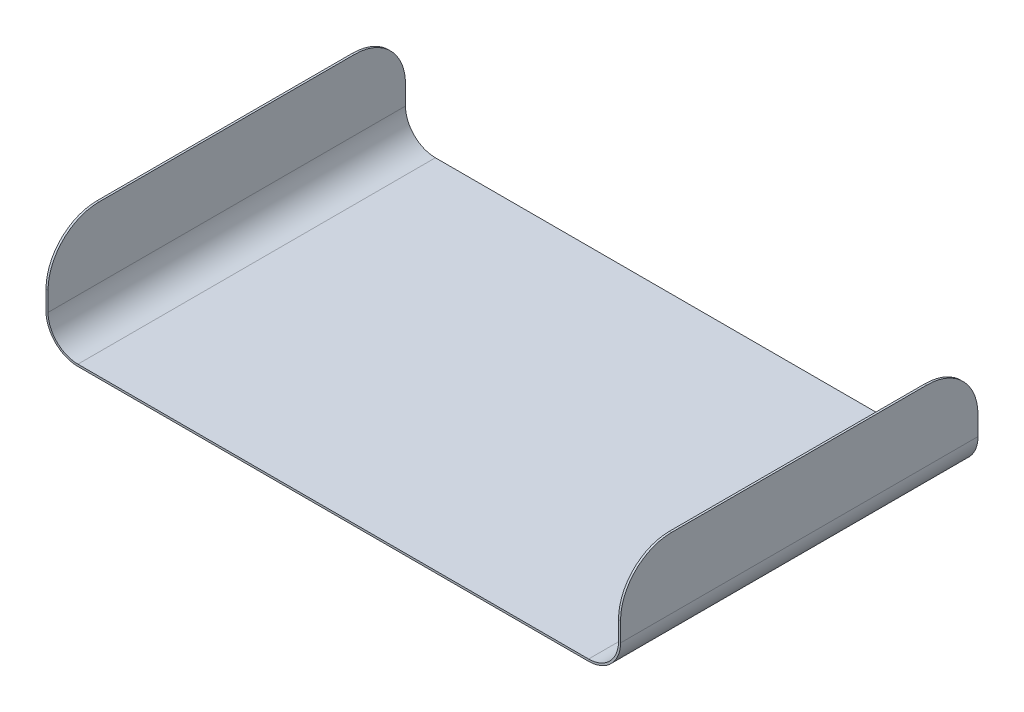
ISO-10303-21;
HEADER;
FILE_DESCRIPTION(('STEP AP214'),'2;1');
FILE_NAME('part.step','',(''),(''),'','','');
FILE_SCHEMA(('AUTOMOTIVE_DESIGN { 1 0 10303 214 1 1 1 1 }'));
ENDSEC;
DATA;
#1=APPLICATION_CONTEXT('core data for automotive mechanical design processes');
#2=APPLICATION_PROTOCOL_DEFINITION('international standard','automotive_design',2000,#1);
#3=PRODUCT_CONTEXT('',#1,'mechanical');
#4=PRODUCT('Part','Part','',(#3));
#5=PRODUCT_RELATED_PRODUCT_CATEGORY('part','',(#4));
#6=PRODUCT_DEFINITION_FORMATION('','',#4);
#7=PRODUCT_DEFINITION_CONTEXT('part definition',#1,'design');
#8=PRODUCT_DEFINITION('design','',#6,#7);
#9=PRODUCT_DEFINITION_SHAPE('','',#8);
#10=(LENGTH_UNIT() NAMED_UNIT(*) SI_UNIT(.MILLI.,.METRE.));
#11=(NAMED_UNIT(*) PLANE_ANGLE_UNIT() SI_UNIT($,.RADIAN.));
#12=(NAMED_UNIT(*) SI_UNIT($,.STERADIAN.) SOLID_ANGLE_UNIT());
#13=UNCERTAINTY_MEASURE_WITH_UNIT(LENGTH_MEASURE(1.E-05),#10,'distance_accuracy_value','');
#14=(GEOMETRIC_REPRESENTATION_CONTEXT(3) GLOBAL_UNCERTAINTY_ASSIGNED_CONTEXT((#13)) GLOBAL_UNIT_ASSIGNED_CONTEXT((#10,
#11,#12)) REPRESENTATION_CONTEXT('',''));
#15=CARTESIAN_POINT('',(0.,0.,0.));
#16=DIRECTION('',(0.,0.,1.));
#17=DIRECTION('',(1.,0.,0.));
#18=AXIS2_PLACEMENT_3D('',#15,#16,#17);
#19=CARTESIAN_POINT('',(-142.875,-168.275,88.9));
#20=DIRECTION('',(0.,-1.,0.));
#21=DIRECTION('',(0.,0.,-1.));
#22=AXIS2_PLACEMENT_3D('',#19,#20,#21);
#23=PLANE('',#22);
#24=DIRECTION('',(0.,0.,-1.));
#25=VECTOR('',#24,1.);
#26=CARTESIAN_POINT('',(-141.859,-168.275,88.9));
#27=LINE('',#26,#25);
#28=CARTESIAN_POINT('',(-141.859,-168.275,63.5));
#29=VERTEX_POINT('',#28);
#30=CARTESIAN_POINT('',(-141.859,-168.275,-63.5));
#31=VERTEX_POINT('',#30);
#32=EDGE_CURVE('E191',#29,#31,#27,.T.);
#33=ORIENTED_EDGE('',*,*,#32,.T.);
#34=DIRECTION('',(-1.,0.,0.));
#35=VECTOR('',#34,1.);
#36=CARTESIAN_POINT('',(-142.875,-168.275,-63.5));
#37=LINE('',#36,#35);
#38=CARTESIAN_POINT('',(-142.875,-168.275,-63.5));
#39=VERTEX_POINT('',#38);
#40=EDGE_CURVE('E260',#31,#39,#37,.T.);
#41=ORIENTED_EDGE('',*,*,#40,.T.);
#42=DIRECTION('',(0.,0.,-1.));
#43=VECTOR('',#42,1.);
#44=CARTESIAN_POINT('',(-142.875,-168.275,88.9));
#45=LINE('',#44,#43);
#46=CARTESIAN_POINT('',(-142.875,-168.275,63.5));
#47=VERTEX_POINT('',#46);
#48=EDGE_CURVE('E167',#47,#39,#45,.T.);
#49=ORIENTED_EDGE('',*,*,#48,.F.);
#50=DIRECTION('',(-1.,0.,0.));
#51=VECTOR('',#50,1.);
#52=CARTESIAN_POINT('',(-142.875,-168.275,63.5));
#53=LINE('',#52,#51);
#54=EDGE_CURVE('E53',#47,#29,#53,.F.);
#55=ORIENTED_EDGE('',*,*,#54,.T.);
#56=EDGE_LOOP('',(#33,#41,#49,#55));
#57=FACE_BOUND('',#56,.T.);
#58=ADVANCED_FACE('F33',(#57),#23,.F.);
#59=CARTESIAN_POINT('',(-142.875,-168.275,88.9));
#60=DIRECTION('',(1.,0.,0.));
#61=DIRECTION('',(0.,0.,-1.));
#62=AXIS2_PLACEMENT_3D('',#59,#60,#61);
#63=PLANE('',#62);
#64=ORIENTED_EDGE('',*,*,#48,.T.);
#65=CARTESIAN_POINT('',(-142.875,-193.675,-63.5));
#66=DIRECTION('',(1.,0.,0.));
#67=DIRECTION('',(0.,0.,-1.));
#68=AXIS2_PLACEMENT_3D('',#65,#66,#67);
#69=CIRCLE('',#68,25.4);
#70=CARTESIAN_POINT('',(-142.875,-193.675,-88.9));
#71=VERTEX_POINT('',#70);
#72=EDGE_CURVE('E265',#39,#71,#69,.F.);
#73=ORIENTED_EDGE('',*,*,#72,.T.);
#74=DIRECTION('',(0.,-1.,0.));
#75=VECTOR('',#74,1.);
#76=CARTESIAN_POINT('',(-142.875,-168.275,-88.9));
#77=LINE('',#76,#75);
#78=CARTESIAN_POINT('',(-142.875,-203.2,-88.9));
#79=VERTEX_POINT('',#78);
#80=EDGE_CURVE('E164',#71,#79,#77,.T.);
#81=ORIENTED_EDGE('',*,*,#80,.T.);
#82=DIRECTION('',(0.,0.,-1.));
#83=VECTOR('',#82,1.);
#84=CARTESIAN_POINT('',(-142.875,-203.2,88.9));
#85=LINE('',#84,#83);
#86=CARTESIAN_POINT('',(-142.875,-203.2,88.9));
#87=VERTEX_POINT('',#86);
#88=EDGE_CURVE('E160',#87,#79,#85,.T.);
#89=ORIENTED_EDGE('',*,*,#88,.F.);
#90=DIRECTION('',(0.,-1.,0.));
#91=VECTOR('',#90,1.);
#92=CARTESIAN_POINT('',(-142.875,-168.275,88.9));
#93=LINE('',#92,#91);
#94=CARTESIAN_POINT('',(-142.875,-193.675,88.9));
#95=VERTEX_POINT('',#94);
#96=EDGE_CURVE('E146',#95,#87,#93,.T.);
#97=ORIENTED_EDGE('',*,*,#96,.F.);
#98=CARTESIAN_POINT('',(-142.875,-193.675,63.5));
#99=DIRECTION('',(1.,0.,0.));
#100=DIRECTION('',(0.,0.,-1.));
#101=AXIS2_PLACEMENT_3D('',#98,#99,#100);
#102=CIRCLE('',#101,25.4);
#103=EDGE_CURVE('E263',#95,#47,#102,.F.);
#104=ORIENTED_EDGE('',*,*,#103,.T.);
#105=EDGE_LOOP('',(#64,#73,#81,#89,#97,#104));
#106=FACE_BOUND('',#105,.T.);
#107=ADVANCED_FACE('F162',(#106),#63,.F.);
#108=CARTESIAN_POINT('',(-127.,-203.2,88.9));
#109=DIRECTION('',(0.,0.,-1.));
#110=DIRECTION('',(-1.,0.,0.));
#111=AXIS2_PLACEMENT_3D('',#108,#109,#110);
#112=CYLINDRICAL_SURFACE('',#111,15.875);
#113=CARTESIAN_POINT('',(-127.,-203.2,-88.9));
#114=DIRECTION('',(0.,0.,1.));
#115=DIRECTION('',(-1.,0.,0.));
#116=AXIS2_PLACEMENT_3D('',#113,#114,#115);
#117=CIRCLE('',#116,15.875);
#118=CARTESIAN_POINT('',(-127.,-219.075,-88.9));
#119=VERTEX_POINT('',#118);
#120=EDGE_CURVE('E193',#79,#119,#117,.T.);
#121=ORIENTED_EDGE('',*,*,#120,.T.);
#122=DIRECTION('',(0.,0.,-1.));
#123=VECTOR('',#122,1.);
#124=CARTESIAN_POINT('',(-127.,-219.075,88.9));
#125=LINE('',#124,#123);
#126=CARTESIAN_POINT('',(-127.,-219.075,88.9));
#127=VERTEX_POINT('',#126);
#128=EDGE_CURVE('E168',#127,#119,#125,.T.);
#129=ORIENTED_EDGE('',*,*,#128,.F.);
#130=CARTESIAN_POINT('',(-127.,-203.2,88.9));
#131=DIRECTION('',(0.,0.,1.));
#132=DIRECTION('',(-1.,0.,0.));
#133=AXIS2_PLACEMENT_3D('',#130,#131,#132);
#134=CIRCLE('',#133,15.875);
#135=EDGE_CURVE('E151',#87,#127,#134,.T.);
#136=ORIENTED_EDGE('',*,*,#135,.F.);
#137=ORIENTED_EDGE('',*,*,#88,.T.);
#138=EDGE_LOOP('',(#121,#129,#136,#137));
#139=FACE_BOUND('',#138,.T.);
#140=ADVANCED_FACE('F170',(#139),#112,.T.);
#141=CARTESIAN_POINT('',(-127.,-219.075,88.9));
#142=DIRECTION('',(0.,1.,0.));
#143=DIRECTION('',(0.,0.,1.));
#144=AXIS2_PLACEMENT_3D('',#141,#142,#143);
#145=PLANE('',#144);
#146=DIRECTION('',(1.,0.,0.));
#147=VECTOR('',#146,1.);
#148=CARTESIAN_POINT('',(-127.,-219.075,-88.9));
#149=LINE('',#148,#147);
#150=CARTESIAN_POINT('',(127.,-219.075,-88.9));
#151=VERTEX_POINT('',#150);
#152=EDGE_CURVE('E195',#119,#151,#149,.T.);
#153=ORIENTED_EDGE('',*,*,#152,.T.);
#154=DIRECTION('',(0.,0.,-1.));
#155=VECTOR('',#154,1.);
#156=CARTESIAN_POINT('',(127.,-219.075,88.9));
#157=LINE('',#156,#155);
#158=CARTESIAN_POINT('',(127.,-219.075,88.9));
#159=VERTEX_POINT('',#158);
#160=EDGE_CURVE('E233',#159,#151,#157,.T.);
#161=ORIENTED_EDGE('',*,*,#160,.F.);
#162=DIRECTION('',(1.,0.,0.));
#163=VECTOR('',#162,1.);
#164=CARTESIAN_POINT('',(-127.,-219.075,88.9));
#165=LINE('',#164,#163);
#166=EDGE_CURVE('E173',#127,#159,#165,.T.);
#167=ORIENTED_EDGE('',*,*,#166,.F.);
#168=ORIENTED_EDGE('',*,*,#128,.T.);
#169=EDGE_LOOP('',(#153,#161,#167,#168));
#170=FACE_BOUND('',#169,.T.);
#171=ADVANCED_FACE('F283',(#170),#145,.F.);
#172=CARTESIAN_POINT('',(127.,-203.2,88.9));
#173=DIRECTION('',(0.,0.,-1.));
#174=DIRECTION('',(-1.,0.,0.));
#175=AXIS2_PLACEMENT_3D('',#172,#173,#174);
#176=CYLINDRICAL_SURFACE('',#175,15.875);
#177=CARTESIAN_POINT('',(127.,-203.2,-88.9));
#178=DIRECTION('',(0.,0.,1.));
#179=DIRECTION('',(-1.,0.,0.));
#180=AXIS2_PLACEMENT_3D('',#177,#178,#179);
#181=CIRCLE('',#180,15.875);
#182=CARTESIAN_POINT('',(142.875,-203.2,-88.9));
#183=VERTEX_POINT('',#182);
#184=EDGE_CURVE('E197',#151,#183,#181,.T.);
#185=ORIENTED_EDGE('',*,*,#184,.T.);
#186=DIRECTION('',(0.,0.,-1.));
#187=VECTOR('',#186,1.);
#188=CARTESIAN_POINT('',(142.875,-203.2,88.9));
#189=LINE('',#188,#187);
#190=CARTESIAN_POINT('',(142.875,-203.2,88.9));
#191=VERTEX_POINT('',#190);
#192=EDGE_CURVE('E230',#191,#183,#189,.T.);
#193=ORIENTED_EDGE('',*,*,#192,.F.);
#194=CARTESIAN_POINT('',(127.,-203.2,88.9));
#195=DIRECTION('',(0.,0.,1.));
#196=DIRECTION('',(-1.,0.,0.));
#197=AXIS2_PLACEMENT_3D('',#194,#195,#196);
#198=CIRCLE('',#197,15.875);
#199=EDGE_CURVE('E175',#159,#191,#198,.T.);
#200=ORIENTED_EDGE('',*,*,#199,.F.);
#201=ORIENTED_EDGE('',*,*,#160,.T.);
#202=EDGE_LOOP('',(#185,#193,#200,#201));
#203=FACE_BOUND('',#202,.T.);
#204=ADVANCED_FACE('F290',(#203),#176,.T.);
#205=CARTESIAN_POINT('',(142.875,-203.2,88.9));
#206=DIRECTION('',(-1.,0.,0.));
#207=DIRECTION('',(0.,-1.,0.));
#208=AXIS2_PLACEMENT_3D('',#205,#206,#207);
#209=PLANE('',#208);
#210=DIRECTION('',(0.,1.,0.));
#211=VECTOR('',#210,1.);
#212=CARTESIAN_POINT('',(142.875,-203.2,-88.9));
#213=LINE('',#212,#211);
#214=CARTESIAN_POINT('',(142.875,-193.675,-88.9));
#215=VERTEX_POINT('',#214);
#216=EDGE_CURVE('E199',#183,#215,#213,.T.);
#217=ORIENTED_EDGE('',*,*,#216,.T.);
#218=CARTESIAN_POINT('',(142.875,-193.675,-63.5));
#219=DIRECTION('',(-1.,0.,0.));
#220=DIRECTION('',(0.,-1.,0.));
#221=AXIS2_PLACEMENT_3D('',#218,#219,#220);
#222=CIRCLE('',#221,25.4);
#223=CARTESIAN_POINT('',(142.875,-168.275,-63.5));
#224=VERTEX_POINT('',#223);
#225=EDGE_CURVE('E253',#215,#224,#222,.F.);
#226=ORIENTED_EDGE('',*,*,#225,.T.);
#227=DIRECTION('',(0.,0.,-1.));
#228=VECTOR('',#227,1.);
#229=CARTESIAN_POINT('',(142.875,-168.275,88.9));
#230=LINE('',#229,#228);
#231=CARTESIAN_POINT('',(142.875,-168.275,63.5));
#232=VERTEX_POINT('',#231);
#233=EDGE_CURVE('E227',#232,#224,#230,.T.);
#234=ORIENTED_EDGE('',*,*,#233,.F.);
#235=CARTESIAN_POINT('',(142.875,-193.675,63.5));
#236=DIRECTION('',(-1.,0.,0.));
#237=DIRECTION('',(0.,-1.,0.));
#238=AXIS2_PLACEMENT_3D('',#235,#236,#237);
#239=CIRCLE('',#238,25.4);
#240=CARTESIAN_POINT('',(142.875,-193.675,88.9));
#241=VERTEX_POINT('',#240);
#242=EDGE_CURVE('E251',#232,#241,#239,.F.);
#243=ORIENTED_EDGE('',*,*,#242,.T.);
#244=DIRECTION('',(0.,1.,0.));
#245=VECTOR('',#244,1.);
#246=CARTESIAN_POINT('',(142.875,-203.2,88.9));
#247=LINE('',#246,#245);
#248=EDGE_CURVE('E179',#191,#241,#247,.T.);
#249=ORIENTED_EDGE('',*,*,#248,.F.);
#250=ORIENTED_EDGE('',*,*,#192,.T.);
#251=EDGE_LOOP('',(#217,#226,#234,#243,#249,#250));
#252=FACE_BOUND('',#251,.T.);
#253=ADVANCED_FACE('F293',(#252),#209,.F.);
#254=CARTESIAN_POINT('',(142.875,-168.275,88.9));
#255=DIRECTION('',(0.,-1.,0.));
#256=DIRECTION('',(0.,0.,-1.));
#257=AXIS2_PLACEMENT_3D('',#254,#255,#256);
#258=PLANE('',#257);
#259=ORIENTED_EDGE('',*,*,#233,.T.);
#260=DIRECTION('',(-1.,0.,0.));
#261=VECTOR('',#260,1.);
#262=CARTESIAN_POINT('',(141.859,-168.275,-63.5));
#263=LINE('',#262,#261);
#264=CARTESIAN_POINT('',(141.859,-168.275,-63.5));
#265=VERTEX_POINT('',#264);
#266=EDGE_CURVE('E240',#224,#265,#263,.T.);
#267=ORIENTED_EDGE('',*,*,#266,.T.);
#268=DIRECTION('',(0.,0.,-1.));
#269=VECTOR('',#268,1.);
#270=CARTESIAN_POINT('',(141.859,-168.275,88.9));
#271=LINE('',#270,#269);
#272=CARTESIAN_POINT('',(141.859,-168.275,63.5));
#273=VERTEX_POINT('',#272);
#274=EDGE_CURVE('E224',#273,#265,#271,.T.);
#275=ORIENTED_EDGE('',*,*,#274,.F.);
#276=DIRECTION('',(-1.,0.,0.));
#277=VECTOR('',#276,1.);
#278=CARTESIAN_POINT('',(142.875,-168.275,63.5));
#279=LINE('',#278,#277);
#280=EDGE_CURVE('E238',#273,#232,#279,.F.);
#281=ORIENTED_EDGE('',*,*,#280,.T.);
#282=EDGE_LOOP('',(#259,#267,#275,#281));
#283=FACE_BOUND('',#282,.T.);
#284=ADVANCED_FACE('F323',(#283),#258,.F.);
#285=CARTESIAN_POINT('',(141.859,-203.2,88.9));
#286=DIRECTION('',(1.,0.,0.));
#287=DIRECTION('',(0.,0.,-1.));
#288=AXIS2_PLACEMENT_3D('',#285,#286,#287);
#289=PLANE('',#288);
#290=ORIENTED_EDGE('',*,*,#274,.T.);
#291=CARTESIAN_POINT('',(141.859,-193.675,-63.5));
#292=DIRECTION('',(1.,0.,0.));
#293=DIRECTION('',(0.,0.,-1.));
#294=AXIS2_PLACEMENT_3D('',#291,#292,#293);
#295=CIRCLE('',#294,25.4);
#296=CARTESIAN_POINT('',(141.859,-193.675,-88.9));
#297=VERTEX_POINT('',#296);
#298=EDGE_CURVE('E245',#265,#297,#295,.F.);
#299=ORIENTED_EDGE('',*,*,#298,.T.);
#300=DIRECTION('',(0.,-1.,0.));
#301=VECTOR('',#300,1.);
#302=CARTESIAN_POINT('',(141.859,-203.2,-88.9));
#303=LINE('',#302,#301);
#304=CARTESIAN_POINT('',(141.859,-203.2,-88.9));
#305=VERTEX_POINT('',#304);
#306=EDGE_CURVE('E202',#297,#305,#303,.T.);
#307=ORIENTED_EDGE('',*,*,#306,.T.);
#308=DIRECTION('',(0.,0.,-1.));
#309=VECTOR('',#308,1.);
#310=CARTESIAN_POINT('',(141.859,-203.2,88.9));
#311=LINE('',#310,#309);
#312=CARTESIAN_POINT('',(141.859,-203.2,88.9));
#313=VERTEX_POINT('',#312);
#314=EDGE_CURVE('E221',#313,#305,#311,.T.);
#315=ORIENTED_EDGE('',*,*,#314,.F.);
#316=DIRECTION('',(0.,-1.,0.));
#317=VECTOR('',#316,1.);
#318=CARTESIAN_POINT('',(141.859,-203.2,88.9));
#319=LINE('',#318,#317);
#320=CARTESIAN_POINT('',(141.859,-193.675,88.9));
#321=VERTEX_POINT('',#320);
#322=EDGE_CURVE('E181',#321,#313,#319,.T.);
#323=ORIENTED_EDGE('',*,*,#322,.F.);
#324=CARTESIAN_POINT('',(141.859,-193.675,63.5));
#325=DIRECTION('',(1.,0.,0.));
#326=DIRECTION('',(0.,0.,-1.));
#327=AXIS2_PLACEMENT_3D('',#324,#325,#326);
#328=CIRCLE('',#327,25.4);
#329=EDGE_CURVE('E243',#321,#273,#328,.F.);
#330=ORIENTED_EDGE('',*,*,#329,.T.);
#331=EDGE_LOOP('',(#290,#299,#307,#315,#323,#330));
#332=FACE_BOUND('',#331,.T.);
#333=ADVANCED_FACE('F302',(#332),#289,.F.);
#334=CARTESIAN_POINT('',(127.,-203.2,88.9));
#335=DIRECTION('',(0.,0.,-1.));
#336=DIRECTION('',(-1.,0.,0.));
#337=AXIS2_PLACEMENT_3D('',#334,#335,#336);
#338=CYLINDRICAL_SURFACE('',#337,14.859);
#339=CARTESIAN_POINT('',(127.,-203.2,-88.9));
#340=DIRECTION('',(0.,0.,-1.));
#341=DIRECTION('',(-1.,0.,0.));
#342=AXIS2_PLACEMENT_3D('',#339,#340,#341);
#343=CIRCLE('',#342,14.859);
#344=CARTESIAN_POINT('',(127.,-218.059,-88.9));
#345=VERTEX_POINT('',#344);
#346=EDGE_CURVE('E204',#305,#345,#343,.T.);
#347=ORIENTED_EDGE('',*,*,#346,.T.);
#348=DIRECTION('',(0.,0.,-1.));
#349=VECTOR('',#348,1.);
#350=CARTESIAN_POINT('',(127.,-218.059,88.9));
#351=LINE('',#350,#349);
#352=CARTESIAN_POINT('',(127.,-218.059,88.9));
#353=VERTEX_POINT('',#352);
#354=EDGE_CURVE('E218',#353,#345,#351,.T.);
#355=ORIENTED_EDGE('',*,*,#354,.F.);
#356=CARTESIAN_POINT('',(127.,-203.2,88.9));
#357=DIRECTION('',(0.,0.,-1.));
#358=DIRECTION('',(-1.,0.,0.));
#359=AXIS2_PLACEMENT_3D('',#356,#357,#358);
#360=CIRCLE('',#359,14.859);
#361=EDGE_CURVE('E183',#313,#353,#360,.T.);
#362=ORIENTED_EDGE('',*,*,#361,.F.);
#363=ORIENTED_EDGE('',*,*,#314,.T.);
#364=EDGE_LOOP('',(#347,#355,#362,#363));
#365=FACE_BOUND('',#364,.T.);
#366=ADVANCED_FACE('F308',(#365),#338,.F.);
#367=CARTESIAN_POINT('',(-127.,-218.059,88.9));
#368=DIRECTION('',(0.,-1.,0.));
#369=DIRECTION('',(0.,0.,-1.));
#370=AXIS2_PLACEMENT_3D('',#367,#368,#369);
#371=PLANE('',#370);
#372=DIRECTION('',(-1.,0.,0.));
#373=VECTOR('',#372,1.);
#374=CARTESIAN_POINT('',(-127.,-218.059,-88.9));
#375=LINE('',#374,#373);
#376=CARTESIAN_POINT('',(-127.,-218.059,-88.9));
#377=VERTEX_POINT('',#376);
#378=EDGE_CURVE('E206',#345,#377,#375,.T.);
#379=ORIENTED_EDGE('',*,*,#378,.T.);
#380=DIRECTION('',(0.,0.,-1.));
#381=VECTOR('',#380,1.);
#382=CARTESIAN_POINT('',(-127.,-218.059,88.9));
#383=LINE('',#382,#381);
#384=CARTESIAN_POINT('',(-127.,-218.059,88.9));
#385=VERTEX_POINT('',#384);
#386=EDGE_CURVE('E215',#385,#377,#383,.T.);
#387=ORIENTED_EDGE('',*,*,#386,.F.);
#388=DIRECTION('',(-1.,0.,0.));
#389=VECTOR('',#388,1.);
#390=CARTESIAN_POINT('',(-127.,-218.059,88.9));
#391=LINE('',#390,#389);
#392=EDGE_CURVE('E185',#353,#385,#391,.T.);
#393=ORIENTED_EDGE('',*,*,#392,.F.);
#394=ORIENTED_EDGE('',*,*,#354,.T.);
#395=EDGE_LOOP('',(#379,#387,#393,#394));
#396=FACE_BOUND('',#395,.T.);
#397=ADVANCED_FACE('F312',(#396),#371,.F.);
#398=CARTESIAN_POINT('',(-127.,-203.2,88.9));
#399=DIRECTION('',(0.,0.,-1.));
#400=DIRECTION('',(-1.,0.,0.));
#401=AXIS2_PLACEMENT_3D('',#398,#399,#400);
#402=CYLINDRICAL_SURFACE('',#401,14.859);
#403=CARTESIAN_POINT('',(-127.,-203.2,-88.9));
#404=DIRECTION('',(0.,0.,-1.));
#405=DIRECTION('',(-1.,0.,0.));
#406=AXIS2_PLACEMENT_3D('',#403,#404,#405);
#407=CIRCLE('',#406,14.859);
#408=CARTESIAN_POINT('',(-141.859,-203.2,-88.9));
#409=VERTEX_POINT('',#408);
#410=EDGE_CURVE('E208',#377,#409,#407,.T.);
#411=ORIENTED_EDGE('',*,*,#410,.T.);
#412=DIRECTION('',(0.,0.,-1.));
#413=VECTOR('',#412,1.);
#414=CARTESIAN_POINT('',(-141.859,-203.2,88.9));
#415=LINE('',#414,#413);
#416=CARTESIAN_POINT('',(-141.859,-203.2,88.9));
#417=VERTEX_POINT('',#416);
#418=EDGE_CURVE('E212',#417,#409,#415,.T.);
#419=ORIENTED_EDGE('',*,*,#418,.F.);
#420=CARTESIAN_POINT('',(-127.,-203.2,88.9));
#421=DIRECTION('',(0.,0.,-1.));
#422=DIRECTION('',(-1.,0.,0.));
#423=AXIS2_PLACEMENT_3D('',#420,#421,#422);
#424=CIRCLE('',#423,14.859);
#425=EDGE_CURVE('E187',#385,#417,#424,.T.);
#426=ORIENTED_EDGE('',*,*,#425,.F.);
#427=ORIENTED_EDGE('',*,*,#386,.T.);
#428=EDGE_LOOP('',(#411,#419,#426,#427));
#429=FACE_BOUND('',#428,.T.);
#430=ADVANCED_FACE('F316',(#429),#402,.F.);
#431=CARTESIAN_POINT('',(-141.859,-168.275,88.9));
#432=DIRECTION('',(-1.,0.,0.));
#433=DIRECTION('',(0.,-1.,0.));
#434=AXIS2_PLACEMENT_3D('',#431,#432,#433);
#435=PLANE('',#434);
#436=DIRECTION('',(0.,1.,0.));
#437=VECTOR('',#436,1.);
#438=CARTESIAN_POINT('',(-141.859,-168.275,-88.9));
#439=LINE('',#438,#437);
#440=CARTESIAN_POINT('',(-141.859,-193.675,-88.9));
#441=VERTEX_POINT('',#440);
#442=EDGE_CURVE('E157',#409,#441,#439,.T.);
#443=ORIENTED_EDGE('',*,*,#442,.T.);
#444=CARTESIAN_POINT('',(-141.859,-193.675,-63.5));
#445=DIRECTION('',(-1.,0.,0.));
#446=DIRECTION('',(0.,-1.,0.));
#447=AXIS2_PLACEMENT_3D('',#444,#445,#446);
#448=CIRCLE('',#447,25.4);
#449=EDGE_CURVE('E11',#441,#31,#448,.F.);
#450=ORIENTED_EDGE('',*,*,#449,.T.);
#451=ORIENTED_EDGE('',*,*,#32,.F.);
#452=CARTESIAN_POINT('',(-141.859,-193.675,63.5));
#453=DIRECTION('',(-1.,0.,0.));
#454=DIRECTION('',(0.,-1.,0.));
#455=AXIS2_PLACEMENT_3D('',#452,#453,#454);
#456=CIRCLE('',#455,25.4);
#457=CARTESIAN_POINT('',(-141.859,-193.675,88.9));
#458=VERTEX_POINT('',#457);
#459=EDGE_CURVE('E41',#29,#458,#456,.F.);
#460=ORIENTED_EDGE('',*,*,#459,.T.);
#461=DIRECTION('',(0.,1.,0.));
#462=VECTOR('',#461,1.);
#463=CARTESIAN_POINT('',(-141.859,-168.275,88.9));
#464=LINE('',#463,#462);
#465=EDGE_CURVE('E189',#417,#458,#464,.T.);
#466=ORIENTED_EDGE('',*,*,#465,.F.);
#467=ORIENTED_EDGE('',*,*,#418,.T.);
#468=EDGE_LOOP('',(#443,#450,#451,#460,#466,#467));
#469=FACE_BOUND('',#468,.T.);
#470=ADVANCED_FACE('F268',(#469),#435,.F.);
#471=CARTESIAN_POINT('',(-127.,-203.2,88.9));
#472=DIRECTION('',(0.,0.,-1.));
#473=DIRECTION('',(-1.,0.,0.));
#474=AXIS2_PLACEMENT_3D('',#471,#472,#473);
#475=PLANE('',#474);
#476=ORIENTED_EDGE('',*,*,#248,.T.);
#477=DIRECTION('',(-1.,0.,0.));
#478=VECTOR('',#477,1.);
#479=CARTESIAN_POINT('',(-127.,-193.675,88.9));
#480=LINE('',#479,#478);
#481=EDGE_CURVE('E256',#241,#321,#480,.T.);
#482=ORIENTED_EDGE('',*,*,#481,.T.);
#483=ORIENTED_EDGE('',*,*,#322,.T.);
#484=ORIENTED_EDGE('',*,*,#361,.T.);
#485=ORIENTED_EDGE('',*,*,#392,.T.);
#486=ORIENTED_EDGE('',*,*,#425,.T.);
#487=ORIENTED_EDGE('',*,*,#465,.T.);
#488=DIRECTION('',(-1.,0.,0.));
#489=VECTOR('',#488,1.);
#490=CARTESIAN_POINT('',(-127.,-193.675,88.9));
#491=LINE('',#490,#489);
#492=EDGE_CURVE('E155',#458,#95,#491,.T.);
#493=ORIENTED_EDGE('',*,*,#492,.T.);
#494=ORIENTED_EDGE('',*,*,#96,.T.);
#495=ORIENTED_EDGE('',*,*,#135,.T.);
#496=ORIENTED_EDGE('',*,*,#166,.T.);
#497=ORIENTED_EDGE('',*,*,#199,.T.);
#498=EDGE_LOOP('',(#476,#482,#483,#484,#485,#486,#487,#493,#494,#495,#496,#497));
#499=FACE_BOUND('',#498,.T.);
#500=ADVANCED_FACE('F149',(#499),#475,.F.);
#501=CARTESIAN_POINT('',(-127.,-203.2,-88.9));
#502=DIRECTION('',(0.,0.,-1.));
#503=DIRECTION('',(-1.,0.,0.));
#504=AXIS2_PLACEMENT_3D('',#501,#502,#503);
#505=PLANE('',#504);
#506=ORIENTED_EDGE('',*,*,#306,.F.);
#507=DIRECTION('',(-1.,0.,0.));
#508=VECTOR('',#507,1.);
#509=CARTESIAN_POINT('',(142.875,-193.675,-88.9));
#510=LINE('',#509,#508);
#511=EDGE_CURVE('E249',#297,#215,#510,.F.);
#512=ORIENTED_EDGE('',*,*,#511,.T.);
#513=ORIENTED_EDGE('',*,*,#216,.F.);
#514=ORIENTED_EDGE('',*,*,#184,.F.);
#515=ORIENTED_EDGE('',*,*,#152,.F.);
#516=ORIENTED_EDGE('',*,*,#120,.F.);
#517=ORIENTED_EDGE('',*,*,#80,.F.);
#518=DIRECTION('',(-1.,0.,0.));
#519=VECTOR('',#518,1.);
#520=CARTESIAN_POINT('',(-141.859,-193.675,-88.9));
#521=LINE('',#520,#519);
#522=EDGE_CURVE('E247',#71,#441,#521,.F.);
#523=ORIENTED_EDGE('',*,*,#522,.T.);
#524=ORIENTED_EDGE('',*,*,#442,.F.);
#525=ORIENTED_EDGE('',*,*,#410,.F.);
#526=ORIENTED_EDGE('',*,*,#378,.F.);
#527=ORIENTED_EDGE('',*,*,#346,.F.);
#528=EDGE_LOOP('',(#506,#512,#513,#514,#515,#516,#517,#523,#524,#525,#526,#527));
#529=FACE_BOUND('',#528,.T.);
#530=ADVANCED_FACE('F278',(#529),#505,.T.);
#531=CARTESIAN_POINT('',(142.875,-193.675,-63.5));
#532=DIRECTION('',(1.,0.,0.));
#533=DIRECTION('',(0.,0.,-1.));
#534=AXIS2_PLACEMENT_3D('',#531,#532,#533);
#535=CYLINDRICAL_SURFACE('',#534,25.4);
#536=ORIENTED_EDGE('',*,*,#225,.F.);
#537=ORIENTED_EDGE('',*,*,#511,.F.);
#538=ORIENTED_EDGE('',*,*,#298,.F.);
#539=ORIENTED_EDGE('',*,*,#266,.F.);
#540=EDGE_LOOP('',(#536,#537,#538,#539));
#541=FACE_BOUND('',#540,.T.);
#542=ADVANCED_FACE('F320',(#541),#535,.T.);
#543=CARTESIAN_POINT('',(-127.,-193.675,63.5));
#544=DIRECTION('',(-1.,0.,0.));
#545=DIRECTION('',(0.,0.,1.));
#546=AXIS2_PLACEMENT_3D('',#543,#544,#545);
#547=CYLINDRICAL_SURFACE('',#546,25.4);
#548=ORIENTED_EDGE('',*,*,#242,.F.);
#549=ORIENTED_EDGE('',*,*,#280,.F.);
#550=ORIENTED_EDGE('',*,*,#329,.F.);
#551=ORIENTED_EDGE('',*,*,#481,.F.);
#552=EDGE_LOOP('',(#548,#549,#550,#551));
#553=FACE_BOUND('',#552,.T.);
#554=ADVANCED_FACE('F298',(#553),#547,.T.);
#555=CARTESIAN_POINT('',(-142.875,-193.675,-63.5));
#556=DIRECTION('',(1.,0.,0.));
#557=DIRECTION('',(0.,0.,-1.));
#558=AXIS2_PLACEMENT_3D('',#555,#556,#557);
#559=CYLINDRICAL_SURFACE('',#558,25.4);
#560=ORIENTED_EDGE('',*,*,#449,.F.);
#561=ORIENTED_EDGE('',*,*,#522,.F.);
#562=ORIENTED_EDGE('',*,*,#72,.F.);
#563=ORIENTED_EDGE('',*,*,#40,.F.);
#564=EDGE_LOOP('',(#560,#561,#562,#563));
#565=FACE_BOUND('',#564,.T.);
#566=ADVANCED_FACE('F274',(#565),#559,.T.);
#567=CARTESIAN_POINT('',(-127.,-193.675,63.5));
#568=DIRECTION('',(-1.,0.,0.));
#569=DIRECTION('',(0.,0.,1.));
#570=AXIS2_PLACEMENT_3D('',#567,#568,#569);
#571=CYLINDRICAL_SURFACE('',#570,25.4);
#572=ORIENTED_EDGE('',*,*,#459,.F.);
#573=ORIENTED_EDGE('',*,*,#54,.F.);
#574=ORIENTED_EDGE('',*,*,#103,.F.);
#575=ORIENTED_EDGE('',*,*,#492,.F.);
#576=EDGE_LOOP('',(#572,#573,#574,#575));
#577=FACE_BOUND('',#576,.T.);
#578=ADVANCED_FACE('F35',(#577),#571,.T.);
#579=CLOSED_SHELL('',(#58,#107,#140,#171,#204,#253,#284,#333,#366,#397,#430,#470,#500,#530,#542,
#554,#566,#578));
#580=MANIFOLD_SOLID_BREP('B2',#579);
#581=ADVANCED_BREP_SHAPE_REPRESENTATION('',(#18,#580),#14);
#582=SHAPE_DEFINITION_REPRESENTATION(#9,#581);
ENDSEC;
END-ISO-10303-21;
